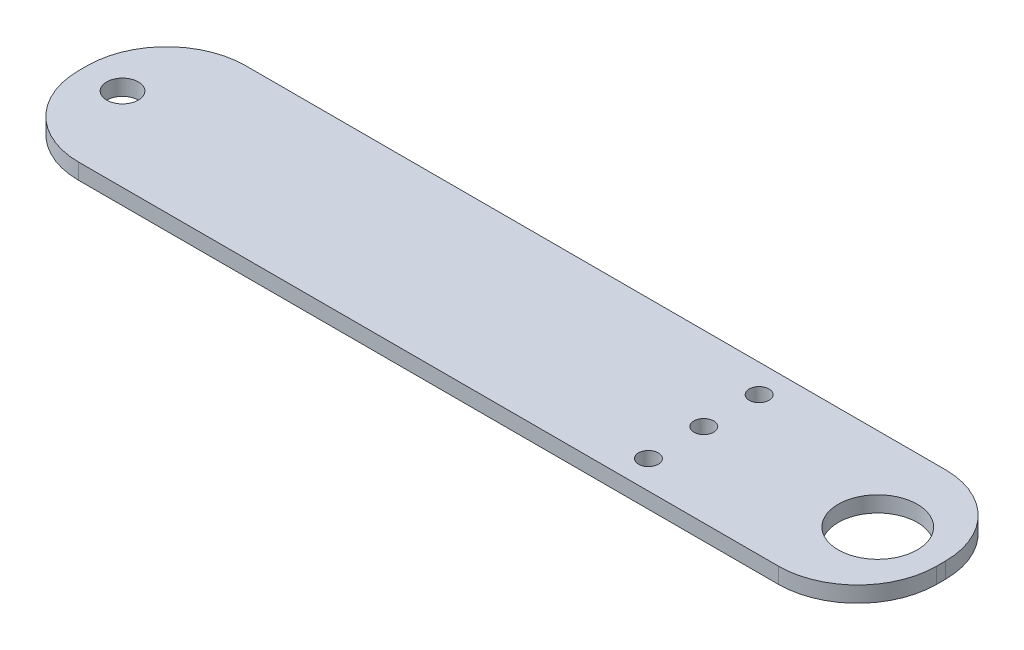
ISO-10303-21;
HEADER;
FILE_DESCRIPTION(('STEP AP214'),'2;1');
FILE_NAME('part.step','',(''),(''),'','','');
FILE_SCHEMA(('AUTOMOTIVE_DESIGN { 1 0 10303 214 1 1 1 1 }'));
ENDSEC;
DATA;
#1=APPLICATION_CONTEXT('core data for automotive mechanical design processes');
#2=APPLICATION_PROTOCOL_DEFINITION('international standard','automotive_design',2000,#1);
#3=PRODUCT_CONTEXT('',#1,'mechanical');
#4=PRODUCT('Part','Part','',(#3));
#5=PRODUCT_RELATED_PRODUCT_CATEGORY('part','',(#4));
#6=PRODUCT_DEFINITION_FORMATION('','',#4);
#7=PRODUCT_DEFINITION_CONTEXT('part definition',#1,'design');
#8=PRODUCT_DEFINITION('design','',#6,#7);
#9=PRODUCT_DEFINITION_SHAPE('','',#8);
#10=(LENGTH_UNIT() NAMED_UNIT(*) SI_UNIT(.MILLI.,.METRE.));
#11=(NAMED_UNIT(*) PLANE_ANGLE_UNIT() SI_UNIT($,.RADIAN.));
#12=(NAMED_UNIT(*) SI_UNIT($,.STERADIAN.) SOLID_ANGLE_UNIT());
#13=UNCERTAINTY_MEASURE_WITH_UNIT(LENGTH_MEASURE(1.E-05),#10,'distance_accuracy_value','');
#14=(GEOMETRIC_REPRESENTATION_CONTEXT(3) GLOBAL_UNCERTAINTY_ASSIGNED_CONTEXT((#13)) GLOBAL_UNIT_ASSIGNED_CONTEXT((#10,
#11,#12)) REPRESENTATION_CONTEXT('',''));
#15=CARTESIAN_POINT('',(0.,0.,0.));
#16=DIRECTION('',(0.,0.,1.));
#17=DIRECTION('',(1.,0.,0.));
#18=AXIS2_PLACEMENT_3D('',#15,#16,#17);
#19=CARTESIAN_POINT('',(-38.5,2.,0.));
#20=DIRECTION('',(-1.,0.,0.));
#21=DIRECTION('',(0.,0.,1.));
#22=AXIS2_PLACEMENT_3D('',#19,#20,#21);
#23=PLANE('',#22);
#24=DIRECTION('',(0.,0.,-1.));
#25=VECTOR('',#24,1.);
#26=CARTESIAN_POINT('',(-38.5,2.,0.));
#27=LINE('',#26,#25);
#28=CARTESIAN_POINT('',(-38.5,2.,0.558375634517767));
#29=VERTEX_POINT('',#28);
#30=CARTESIAN_POINT('',(-38.5,2.,-0.558375634517767));
#31=VERTEX_POINT('',#30);
#32=EDGE_CURVE('E175',#29,#31,#27,.T.);
#33=ORIENTED_EDGE('',*,*,#32,.T.);
#34=DIRECTION('',(0.,-1.,0.));
#35=VECTOR('',#34,1.);
#36=CARTESIAN_POINT('',(-38.5,2.,-0.558375634517767));
#37=LINE('',#36,#35);
#38=CARTESIAN_POINT('',(-38.5,0.,-0.558375634517767));
#39=VERTEX_POINT('',#38);
#40=EDGE_CURVE('E125',#31,#39,#37,.T.);
#41=ORIENTED_EDGE('',*,*,#40,.T.);
#42=DIRECTION('',(0.,0.,-1.));
#43=VECTOR('',#42,1.);
#44=CARTESIAN_POINT('',(-38.5,0.,0.));
#45=LINE('',#44,#43);
#46=CARTESIAN_POINT('',(-38.5,0.,0.558375634517767));
#47=VERTEX_POINT('',#46);
#48=EDGE_CURVE('E108',#47,#39,#45,.T.);
#49=ORIENTED_EDGE('',*,*,#48,.F.);
#50=DIRECTION('',(0.,-1.,0.));
#51=VECTOR('',#50,1.);
#52=CARTESIAN_POINT('',(-38.5,2.,0.558375634517767));
#53=LINE('',#52,#51);
#54=EDGE_CURVE('E119',#47,#29,#53,.F.);
#55=ORIENTED_EDGE('',*,*,#54,.T.);
#56=EDGE_LOOP('',(#33,#41,#49,#55));
#57=FACE_BOUND('',#56,.T.);
#58=ADVANCED_FACE('F37',(#57),#23,.T.);
#59=CARTESIAN_POINT('',(0.,2.,10.5583756345178));
#60=DIRECTION('',(0.,0.,-1.));
#61=DIRECTION('',(-1.,0.,0.));
#62=AXIS2_PLACEMENT_3D('',#59,#60,#61);
#63=PLANE('',#62);
#64=DIRECTION('',(1.,0.,0.));
#65=VECTOR('',#64,1.);
#66=CARTESIAN_POINT('',(0.,2.,10.5583756345178));
#67=LINE('',#66,#65);
#68=CARTESIAN_POINT('',(-28.5,2.,10.5583756345178));
#69=VERTEX_POINT('',#68);
#70=CARTESIAN_POINT('',(60.,2.,10.5583756345178));
#71=VERTEX_POINT('',#70);
#72=EDGE_CURVE('E171',#69,#71,#67,.T.);
#73=ORIENTED_EDGE('',*,*,#72,.F.);
#74=DIRECTION('',(0.,-1.,0.));
#75=VECTOR('',#74,1.);
#76=CARTESIAN_POINT('',(-28.5,0.,10.5583756345178));
#77=LINE('',#76,#75);
#78=CARTESIAN_POINT('',(-28.5,0.,10.5583756345178));
#79=VERTEX_POINT('',#78);
#80=EDGE_CURVE('E163',#69,#79,#77,.T.);
#81=ORIENTED_EDGE('',*,*,#80,.T.);
#82=DIRECTION('',(1.,0.,0.));
#83=VECTOR('',#82,1.);
#84=CARTESIAN_POINT('',(0.,0.,10.5583756345178));
#85=LINE('',#84,#83);
#86=CARTESIAN_POINT('',(60.,0.,10.5583756345178));
#87=VERTEX_POINT('',#86);
#88=EDGE_CURVE('E111',#79,#87,#85,.T.);
#89=ORIENTED_EDGE('',*,*,#88,.T.);
#90=DIRECTION('',(0.,-1.,0.));
#91=VECTOR('',#90,1.);
#92=CARTESIAN_POINT('',(60.,2.,10.5583756345178));
#93=LINE('',#92,#91);
#94=EDGE_CURVE('E160',#87,#71,#93,.F.);
#95=ORIENTED_EDGE('',*,*,#94,.T.);
#96=EDGE_LOOP('',(#73,#81,#89,#95));
#97=FACE_BOUND('',#96,.T.);
#98=ADVANCED_FACE('F209',(#97),#63,.F.);
#99=CARTESIAN_POINT('',(70.,2.,0.));
#100=DIRECTION('',(1.,0.,0.));
#101=DIRECTION('',(0.,0.,-1.));
#102=AXIS2_PLACEMENT_3D('',#99,#100,#101);
#103=PLANE('',#102);
#104=DIRECTION('',(0.,0.,1.));
#105=VECTOR('',#104,1.);
#106=CARTESIAN_POINT('',(70.,2.,0.));
#107=LINE('',#106,#105);
#108=CARTESIAN_POINT('',(70.,2.,-0.55837563451777));
#109=VERTEX_POINT('',#108);
#110=CARTESIAN_POINT('',(70.,2.,0.55837563451777));
#111=VERTEX_POINT('',#110);
#112=EDGE_CURVE('E168',#109,#111,#107,.T.);
#113=ORIENTED_EDGE('',*,*,#112,.T.);
#114=DIRECTION('',(0.,-1.,0.));
#115=VECTOR('',#114,1.);
#116=CARTESIAN_POINT('',(70.,0.,0.55837563451777));
#117=LINE('',#116,#115);
#118=CARTESIAN_POINT('',(70.,0.,0.55837563451777));
#119=VERTEX_POINT('',#118);
#120=EDGE_CURVE('E11',#111,#119,#117,.T.);
#121=ORIENTED_EDGE('',*,*,#120,.T.);
#122=DIRECTION('',(0.,0.,1.));
#123=VECTOR('',#122,1.);
#124=CARTESIAN_POINT('',(70.,0.,0.));
#125=LINE('',#124,#123);
#126=CARTESIAN_POINT('',(70.,0.,-0.55837563451777));
#127=VERTEX_POINT('',#126);
#128=EDGE_CURVE('E131',#127,#119,#125,.T.);
#129=ORIENTED_EDGE('',*,*,#128,.F.);
#130=DIRECTION('',(0.,-1.,0.));
#131=VECTOR('',#130,1.);
#132=CARTESIAN_POINT('',(70.,2.,-0.55837563451777));
#133=LINE('',#132,#131);
#134=EDGE_CURVE('E45',#127,#109,#133,.F.);
#135=ORIENTED_EDGE('',*,*,#134,.T.);
#136=EDGE_LOOP('',(#113,#121,#129,#135));
#137=FACE_BOUND('',#136,.T.);
#138=ADVANCED_FACE('F167',(#137),#103,.T.);
#139=CARTESIAN_POINT('',(62.,2.,0.));
#140=DIRECTION('',(0.,-1.,0.));
#141=DIRECTION('',(0.,0.,-1.));
#142=AXIS2_PLACEMENT_3D('',#139,#140,#141);
#143=CYLINDRICAL_SURFACE('',#142,5.);
#144=CARTESIAN_POINT('',(62.,2.,0.));
#145=DIRECTION('',(0.,1.,0.));
#146=DIRECTION('',(0.,0.,1.));
#147=AXIS2_PLACEMENT_3D('',#144,#145,#146);
#148=CIRCLE('',#147,5.);
#149=CARTESIAN_POINT('',(62.,2.,4.99999999999998));
#150=VERTEX_POINT('',#149);
#151=EDGE_CURVE('E248',#150,#150,#148,.T.);
#152=ORIENTED_EDGE('',*,*,#151,.T.);
#153=EDGE_LOOP('',(#152));
#154=FACE_BOUND('',#153,.T.);
#155=CARTESIAN_POINT('',(62.,0.,0.));
#156=DIRECTION('',(0.,1.,0.));
#157=DIRECTION('',(0.,0.,1.));
#158=AXIS2_PLACEMENT_3D('',#155,#156,#157);
#159=CIRCLE('',#158,5.);
#160=CARTESIAN_POINT('',(62.,0.,4.99999999999998));
#161=VERTEX_POINT('',#160);
#162=EDGE_CURVE('E129',#161,#161,#159,.T.);
#163=ORIENTED_EDGE('',*,*,#162,.F.);
#164=EDGE_LOOP('',(#163));
#165=FACE_BOUND('',#164,.T.);
#166=ADVANCED_FACE('F195',(#154,#165),#143,.F.);
#167=CARTESIAN_POINT('',(-33.5000000000009,2.,-1.31838984174237E-13));
#168=DIRECTION('',(0.,-1.,0.));
#169=DIRECTION('',(0.,0.,-1.));
#170=AXIS2_PLACEMENT_3D('',#167,#168,#169);
#171=CYLINDRICAL_SURFACE('',#170,2.00000000000091);
#172=CARTESIAN_POINT('',(-33.5000000000009,2.,-1.31838984174237E-13));
#173=DIRECTION('',(0.,1.,0.));
#174=DIRECTION('',(0.,0.,1.));
#175=AXIS2_PLACEMENT_3D('',#172,#173,#174);
#176=CIRCLE('',#175,2.00000000000091);
#177=CARTESIAN_POINT('',(-33.5000000000009,2.,2.00000000000078));
#178=VERTEX_POINT('',#177);
#179=EDGE_CURVE('E245',#178,#178,#176,.T.);
#180=ORIENTED_EDGE('',*,*,#179,.T.);
#181=EDGE_LOOP('',(#180));
#182=FACE_BOUND('',#181,.T.);
#183=CARTESIAN_POINT('',(-33.5000000000009,0.,-1.31838984174237E-13));
#184=DIRECTION('',(0.,1.,0.));
#185=DIRECTION('',(0.,0.,1.));
#186=AXIS2_PLACEMENT_3D('',#183,#184,#185);
#187=CIRCLE('',#186,2.00000000000091);
#188=CARTESIAN_POINT('',(-33.5000000000009,0.,2.00000000000078));
#189=VERTEX_POINT('',#188);
#190=EDGE_CURVE('E134',#189,#189,#187,.T.);
#191=ORIENTED_EDGE('',*,*,#190,.F.);
#192=EDGE_LOOP('',(#191));
#193=FACE_BOUND('',#192,.T.);
#194=ADVANCED_FACE('F192',(#182,#193),#171,.F.);
#195=CARTESIAN_POINT('',(40.,2.,0.));
#196=DIRECTION('',(0.,-1.,0.));
#197=DIRECTION('',(0.,0.,-1.));
#198=AXIS2_PLACEMENT_3D('',#195,#196,#197);
#199=CYLINDRICAL_SURFACE('',#198,1.25);
#200=CARTESIAN_POINT('',(40.,2.,0.));
#201=DIRECTION('',(0.,1.,0.));
#202=DIRECTION('',(0.,0.,1.));
#203=AXIS2_PLACEMENT_3D('',#200,#201,#202);
#204=CIRCLE('',#203,1.25);
#205=CARTESIAN_POINT('',(40.,2.,1.24999999999999));
#206=VERTEX_POINT('',#205);
#207=EDGE_CURVE('E242',#206,#206,#204,.T.);
#208=ORIENTED_EDGE('',*,*,#207,.T.);
#209=EDGE_LOOP('',(#208));
#210=FACE_BOUND('',#209,.T.);
#211=CARTESIAN_POINT('',(40.,0.,0.));
#212=DIRECTION('',(0.,1.,0.));
#213=DIRECTION('',(0.,0.,1.));
#214=AXIS2_PLACEMENT_3D('',#211,#212,#213);
#215=CIRCLE('',#214,1.25);
#216=CARTESIAN_POINT('',(40.,0.,1.24999999999999));
#217=VERTEX_POINT('',#216);
#218=EDGE_CURVE('E185',#217,#217,#215,.T.);
#219=ORIENTED_EDGE('',*,*,#218,.F.);
#220=EDGE_LOOP('',(#219));
#221=FACE_BOUND('',#220,.T.);
#222=ADVANCED_FACE('F194',(#210,#221),#199,.F.);
#223=CARTESIAN_POINT('',(40.,2.,-7.00000000000001));
#224=DIRECTION('',(0.,-1.,0.));
#225=DIRECTION('',(0.,0.,-1.));
#226=AXIS2_PLACEMENT_3D('',#223,#224,#225);
#227=CYLINDRICAL_SURFACE('',#226,1.25);
#228=CARTESIAN_POINT('',(40.,2.,-7.00000000000001));
#229=DIRECTION('',(0.,1.,0.));
#230=DIRECTION('',(0.,0.,1.));
#231=AXIS2_PLACEMENT_3D('',#228,#229,#230);
#232=CIRCLE('',#231,1.25);
#233=CARTESIAN_POINT('',(40.,2.,-5.75000000000001));
#234=VERTEX_POINT('',#233);
#235=EDGE_CURVE('E238',#234,#234,#232,.T.);
#236=ORIENTED_EDGE('',*,*,#235,.T.);
#237=EDGE_LOOP('',(#236));
#238=FACE_BOUND('',#237,.T.);
#239=CARTESIAN_POINT('',(40.,0.,-7.00000000000001));
#240=DIRECTION('',(0.,1.,0.));
#241=DIRECTION('',(0.,0.,1.));
#242=AXIS2_PLACEMENT_3D('',#239,#240,#241);
#243=CIRCLE('',#242,1.25);
#244=CARTESIAN_POINT('',(40.,0.,-5.75000000000001));
#245=VERTEX_POINT('',#244);
#246=EDGE_CURVE('E182',#245,#245,#243,.T.);
#247=ORIENTED_EDGE('',*,*,#246,.F.);
#248=EDGE_LOOP('',(#247));
#249=FACE_BOUND('',#248,.T.);
#250=ADVANCED_FACE('F202',(#238,#249),#227,.F.);
#251=CARTESIAN_POINT('',(40.,2.,6.99999999999999));
#252=DIRECTION('',(0.,-1.,0.));
#253=DIRECTION('',(0.,0.,-1.));
#254=AXIS2_PLACEMENT_3D('',#251,#252,#253);
#255=CYLINDRICAL_SURFACE('',#254,1.25);
#256=CARTESIAN_POINT('',(40.,2.,6.99999999999999));
#257=DIRECTION('',(0.,1.,0.));
#258=DIRECTION('',(0.,0.,1.));
#259=AXIS2_PLACEMENT_3D('',#256,#257,#258);
#260=CIRCLE('',#259,1.25);
#261=CARTESIAN_POINT('',(40.,2.,8.24999999999999));
#262=VERTEX_POINT('',#261);
#263=EDGE_CURVE('E142',#262,#262,#260,.T.);
#264=ORIENTED_EDGE('',*,*,#263,.T.);
#265=EDGE_LOOP('',(#264));
#266=FACE_BOUND('',#265,.T.);
#267=CARTESIAN_POINT('',(40.,0.,6.99999999999999));
#268=DIRECTION('',(0.,1.,0.));
#269=DIRECTION('',(0.,0.,1.));
#270=AXIS2_PLACEMENT_3D('',#267,#268,#269);
#271=CIRCLE('',#270,1.25);
#272=CARTESIAN_POINT('',(40.,0.,8.24999999999999));
#273=VERTEX_POINT('',#272);
#274=EDGE_CURVE('E179',#273,#273,#271,.T.);
#275=ORIENTED_EDGE('',*,*,#274,.F.);
#276=EDGE_LOOP('',(#275));
#277=FACE_BOUND('',#276,.T.);
#278=ADVANCED_FACE('F222',(#266,#277),#255,.F.);
#279=CARTESIAN_POINT('',(0.,2.,-10.5583756345178));
#280=DIRECTION('',(0.,0.,-1.));
#281=DIRECTION('',(-1.,0.,0.));
#282=AXIS2_PLACEMENT_3D('',#279,#280,#281);
#283=PLANE('',#282);
#284=DIRECTION('',(1.,0.,0.));
#285=VECTOR('',#284,1.);
#286=CARTESIAN_POINT('',(0.,0.,-10.5583756345178));
#287=LINE('',#286,#285);
#288=CARTESIAN_POINT('',(-28.5,0.,-10.5583756345178));
#289=VERTEX_POINT('',#288);
#290=CARTESIAN_POINT('',(60.,0.,-10.5583756345178));
#291=VERTEX_POINT('',#290);
#292=EDGE_CURVE('E140',#289,#291,#287,.T.);
#293=ORIENTED_EDGE('',*,*,#292,.F.);
#294=DIRECTION('',(0.,-1.,0.));
#295=VECTOR('',#294,1.);
#296=CARTESIAN_POINT('',(-28.5,2.,-10.5583756345178));
#297=LINE('',#296,#295);
#298=CARTESIAN_POINT('',(-28.5,2.,-10.5583756345178));
#299=VERTEX_POINT('',#298);
#300=EDGE_CURVE('E152',#289,#299,#297,.F.);
#301=ORIENTED_EDGE('',*,*,#300,.T.);
#302=DIRECTION('',(1.,0.,0.));
#303=VECTOR('',#302,1.);
#304=CARTESIAN_POINT('',(0.,2.,-10.5583756345178));
#305=LINE('',#304,#303);
#306=CARTESIAN_POINT('',(60.,2.,-10.5583756345178));
#307=VERTEX_POINT('',#306);
#308=EDGE_CURVE('E126',#299,#307,#305,.T.);
#309=ORIENTED_EDGE('',*,*,#308,.T.);
#310=DIRECTION('',(0.,-1.,0.));
#311=VECTOR('',#310,1.);
#312=CARTESIAN_POINT('',(60.,2.,-10.5583756345178));
#313=LINE('',#312,#311);
#314=EDGE_CURVE('E149',#307,#291,#313,.T.);
#315=ORIENTED_EDGE('',*,*,#314,.T.);
#316=EDGE_LOOP('',(#293,#301,#309,#315));
#317=FACE_BOUND('',#316,.T.);
#318=ADVANCED_FACE('F219',(#317),#283,.T.);
#319=CARTESIAN_POINT('',(0.,2.,0.));
#320=DIRECTION('',(0.,1.,0.));
#321=DIRECTION('',(0.,0.,1.));
#322=AXIS2_PLACEMENT_3D('',#319,#320,#321);
#323=PLANE('',#322);
#324=ORIENTED_EDGE('',*,*,#263,.F.);
#325=EDGE_LOOP('',(#324));
#326=FACE_BOUND('',#325,.T.);
#327=ORIENTED_EDGE('',*,*,#235,.F.);
#328=EDGE_LOOP('',(#327));
#329=FACE_BOUND('',#328,.T.);
#330=ORIENTED_EDGE('',*,*,#207,.F.);
#331=EDGE_LOOP('',(#330));
#332=FACE_BOUND('',#331,.T.);
#333=ORIENTED_EDGE('',*,*,#179,.F.);
#334=EDGE_LOOP('',(#333));
#335=FACE_BOUND('',#334,.T.);
#336=ORIENTED_EDGE('',*,*,#151,.F.);
#337=EDGE_LOOP('',(#336));
#338=FACE_BOUND('',#337,.T.);
#339=ORIENTED_EDGE('',*,*,#308,.F.);
#340=CARTESIAN_POINT('',(-28.5,2.,-0.558375634517767));
#341=DIRECTION('',(0.,1.,0.));
#342=DIRECTION('',(0.,0.,1.));
#343=AXIS2_PLACEMENT_3D('',#340,#341,#342);
#344=CIRCLE('',#343,10.);
#345=EDGE_CURVE('E158',#299,#31,#344,.T.);
#346=ORIENTED_EDGE('',*,*,#345,.T.);
#347=ORIENTED_EDGE('',*,*,#32,.F.);
#348=CARTESIAN_POINT('',(-28.5,2.,0.558375634517767));
#349=DIRECTION('',(0.,1.,0.));
#350=DIRECTION('',(0.,0.,1.));
#351=AXIS2_PLACEMENT_3D('',#348,#349,#350);
#352=CIRCLE('',#351,10.);
#353=EDGE_CURVE('E121',#29,#69,#352,.T.);
#354=ORIENTED_EDGE('',*,*,#353,.T.);
#355=ORIENTED_EDGE('',*,*,#72,.T.);
#356=CARTESIAN_POINT('',(60.,2.,0.55837563451777));
#357=DIRECTION('',(0.,1.,0.));
#358=DIRECTION('',(0.,0.,1.));
#359=AXIS2_PLACEMENT_3D('',#356,#357,#358);
#360=CIRCLE('',#359,10.);
#361=EDGE_CURVE('E52',#71,#111,#360,.T.);
#362=ORIENTED_EDGE('',*,*,#361,.T.);
#363=ORIENTED_EDGE('',*,*,#112,.F.);
#364=CARTESIAN_POINT('',(60.,2.,-0.55837563451777));
#365=DIRECTION('',(0.,1.,0.));
#366=DIRECTION('',(0.,0.,1.));
#367=AXIS2_PLACEMENT_3D('',#364,#365,#366);
#368=CIRCLE('',#367,10.);
#369=EDGE_CURVE('E60',#109,#307,#368,.T.);
#370=ORIENTED_EDGE('',*,*,#369,.T.);
#371=EDGE_LOOP('',(#339,#346,#347,#354,#355,#362,#363,#370));
#372=FACE_BOUND('',#371,.T.);
#373=ADVANCED_FACE('F170',(#326,#329,#332,#335,#338,#372),#323,.T.);
#374=CARTESIAN_POINT('',(0.,0.,0.));
#375=DIRECTION('',(0.,1.,0.));
#376=DIRECTION('',(0.,0.,1.));
#377=AXIS2_PLACEMENT_3D('',#374,#375,#376);
#378=PLANE('',#377);
#379=ORIENTED_EDGE('',*,*,#274,.T.);
#380=EDGE_LOOP('',(#379));
#381=FACE_BOUND('',#380,.T.);
#382=ORIENTED_EDGE('',*,*,#246,.T.);
#383=EDGE_LOOP('',(#382));
#384=FACE_BOUND('',#383,.T.);
#385=ORIENTED_EDGE('',*,*,#218,.T.);
#386=EDGE_LOOP('',(#385));
#387=FACE_BOUND('',#386,.T.);
#388=ORIENTED_EDGE('',*,*,#190,.T.);
#389=EDGE_LOOP('',(#388));
#390=FACE_BOUND('',#389,.T.);
#391=ORIENTED_EDGE('',*,*,#162,.T.);
#392=EDGE_LOOP('',(#391));
#393=FACE_BOUND('',#392,.T.);
#394=ORIENTED_EDGE('',*,*,#48,.T.);
#395=CARTESIAN_POINT('',(-28.5,0.,-0.558375634517767));
#396=DIRECTION('',(0.,1.,0.));
#397=DIRECTION('',(0.,0.,1.));
#398=AXIS2_PLACEMENT_3D('',#395,#396,#397);
#399=CIRCLE('',#398,10.);
#400=EDGE_CURVE('E115',#39,#289,#399,.F.);
#401=ORIENTED_EDGE('',*,*,#400,.T.);
#402=ORIENTED_EDGE('',*,*,#292,.T.);
#403=CARTESIAN_POINT('',(60.,0.,-0.55837563451777));
#404=DIRECTION('',(0.,1.,0.));
#405=DIRECTION('',(0.,0.,1.));
#406=AXIS2_PLACEMENT_3D('',#403,#404,#405);
#407=CIRCLE('',#406,10.);
#408=EDGE_CURVE('E145',#291,#127,#407,.F.);
#409=ORIENTED_EDGE('',*,*,#408,.T.);
#410=ORIENTED_EDGE('',*,*,#128,.T.);
#411=CARTESIAN_POINT('',(60.,0.,0.55837563451777));
#412=DIRECTION('',(0.,1.,0.));
#413=DIRECTION('',(0.,0.,1.));
#414=AXIS2_PLACEMENT_3D('',#411,#412,#413);
#415=CIRCLE('',#414,10.);
#416=EDGE_CURVE('E116',#119,#87,#415,.F.);
#417=ORIENTED_EDGE('',*,*,#416,.T.);
#418=ORIENTED_EDGE('',*,*,#88,.F.);
#419=CARTESIAN_POINT('',(-28.5,0.,0.558375634517767));
#420=DIRECTION('',(0.,1.,0.));
#421=DIRECTION('',(0.,0.,1.));
#422=AXIS2_PLACEMENT_3D('',#419,#420,#421);
#423=CIRCLE('',#422,10.);
#424=EDGE_CURVE('E104',#79,#47,#423,.F.);
#425=ORIENTED_EDGE('',*,*,#424,.T.);
#426=EDGE_LOOP('',(#394,#401,#402,#409,#410,#417,#418,#425));
#427=FACE_BOUND('',#426,.T.);
#428=ADVANCED_FACE('F106',(#381,#384,#387,#390,#393,#427),#378,.F.);
#429=CARTESIAN_POINT('',(-28.5,2.,-0.558375634517767));
#430=DIRECTION('',(0.,-1.,0.));
#431=DIRECTION('',(0.,0.,-1.));
#432=AXIS2_PLACEMENT_3D('',#429,#430,#431);
#433=CYLINDRICAL_SURFACE('',#432,10.);
#434=ORIENTED_EDGE('',*,*,#345,.F.);
#435=ORIENTED_EDGE('',*,*,#300,.F.);
#436=ORIENTED_EDGE('',*,*,#400,.F.);
#437=ORIENTED_EDGE('',*,*,#40,.F.);
#438=EDGE_LOOP('',(#434,#435,#436,#437));
#439=FACE_BOUND('',#438,.T.);
#440=ADVANCED_FACE('F226',(#439),#433,.T.);
#441=CARTESIAN_POINT('',(-28.5,2.,0.558375634517767));
#442=DIRECTION('',(0.,1.,0.));
#443=DIRECTION('',(0.,0.,1.));
#444=AXIS2_PLACEMENT_3D('',#441,#442,#443);
#445=CYLINDRICAL_SURFACE('',#444,10.);
#446=ORIENTED_EDGE('',*,*,#353,.F.);
#447=ORIENTED_EDGE('',*,*,#54,.F.);
#448=ORIENTED_EDGE('',*,*,#424,.F.);
#449=ORIENTED_EDGE('',*,*,#80,.F.);
#450=EDGE_LOOP('',(#446,#447,#448,#449));
#451=FACE_BOUND('',#450,.T.);
#452=ADVANCED_FACE('F120',(#451),#445,.T.);
#453=CARTESIAN_POINT('',(60.,2.,0.55837563451777));
#454=DIRECTION('',(0.,1.,0.));
#455=DIRECTION('',(0.,0.,1.));
#456=AXIS2_PLACEMENT_3D('',#453,#454,#455);
#457=CYLINDRICAL_SURFACE('',#456,10.);
#458=ORIENTED_EDGE('',*,*,#361,.F.);
#459=ORIENTED_EDGE('',*,*,#94,.F.);
#460=ORIENTED_EDGE('',*,*,#416,.F.);
#461=ORIENTED_EDGE('',*,*,#120,.F.);
#462=EDGE_LOOP('',(#458,#459,#460,#461));
#463=FACE_BOUND('',#462,.T.);
#464=ADVANCED_FACE('F275',(#463),#457,.T.);
#465=CARTESIAN_POINT('',(60.,2.,-0.55837563451777));
#466=DIRECTION('',(0.,-1.,0.));
#467=DIRECTION('',(0.,0.,-1.));
#468=AXIS2_PLACEMENT_3D('',#465,#466,#467);
#469=CYLINDRICAL_SURFACE('',#468,10.);
#470=ORIENTED_EDGE('',*,*,#369,.F.);
#471=ORIENTED_EDGE('',*,*,#134,.F.);
#472=ORIENTED_EDGE('',*,*,#408,.F.);
#473=ORIENTED_EDGE('',*,*,#314,.F.);
#474=EDGE_LOOP('',(#470,#471,#472,#473));
#475=FACE_BOUND('',#474,.T.);
#476=ADVANCED_FACE('F39',(#475),#469,.T.);
#477=CLOSED_SHELL('',(#58,#98,#138,#166,#194,#222,#250,#278,#318,#373,#428,#440,#452,#464,#476));
#478=MANIFOLD_SOLID_BREP('B2',#477);
#479=ADVANCED_BREP_SHAPE_REPRESENTATION('',(#18,#478),#14);
#480=SHAPE_DEFINITION_REPRESENTATION(#9,#479);
ENDSEC;
END-ISO-10303-21;
